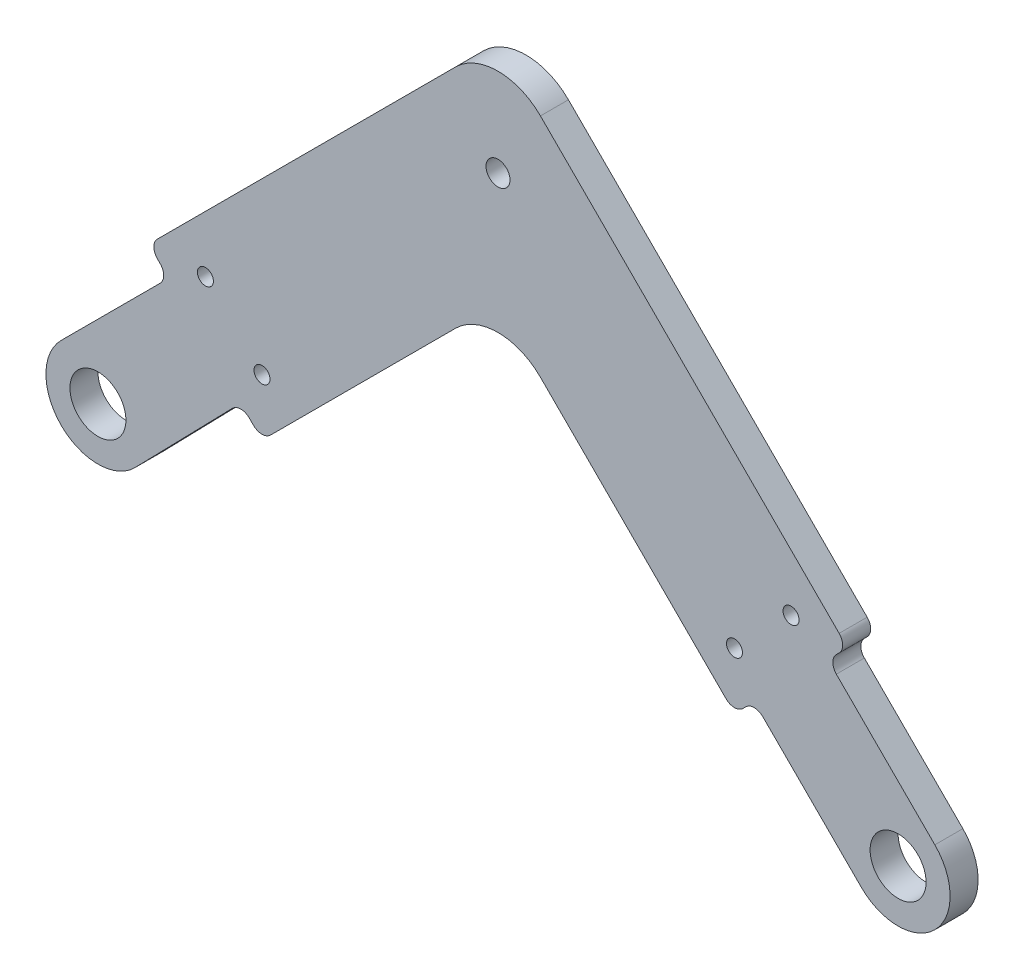
ISO-10303-21;
HEADER;
FILE_DESCRIPTION(('STEP AP214'),'2;1');
FILE_NAME('part.step','',(''),(''),'','','');
FILE_SCHEMA(('AUTOMOTIVE_DESIGN { 1 0 10303 214 1 1 1 1 }'));
ENDSEC;
DATA;
#1=APPLICATION_CONTEXT('core data for automotive mechanical design processes');
#2=APPLICATION_PROTOCOL_DEFINITION('international standard','automotive_design',2000,#1);
#3=PRODUCT_CONTEXT('',#1,'mechanical');
#4=PRODUCT('Part','Part','',(#3));
#5=PRODUCT_RELATED_PRODUCT_CATEGORY('part','',(#4));
#6=PRODUCT_DEFINITION_FORMATION('','',#4);
#7=PRODUCT_DEFINITION_CONTEXT('part definition',#1,'design');
#8=PRODUCT_DEFINITION('design','',#6,#7);
#9=PRODUCT_DEFINITION_SHAPE('','',#8);
#10=(LENGTH_UNIT() NAMED_UNIT(*) SI_UNIT(.MILLI.,.METRE.));
#11=(NAMED_UNIT(*) PLANE_ANGLE_UNIT() SI_UNIT($,.RADIAN.));
#12=(NAMED_UNIT(*) SI_UNIT($,.STERADIAN.) SOLID_ANGLE_UNIT());
#13=UNCERTAINTY_MEASURE_WITH_UNIT(LENGTH_MEASURE(1.E-05),#10,'distance_accuracy_value','');
#14=(GEOMETRIC_REPRESENTATION_CONTEXT(3) GLOBAL_UNCERTAINTY_ASSIGNED_CONTEXT((#13)) GLOBAL_UNIT_ASSIGNED_CONTEXT((#10,
#11,#12)) REPRESENTATION_CONTEXT('',''));
#15=CARTESIAN_POINT('',(0.,0.,0.));
#16=DIRECTION('',(0.,0.,1.));
#17=DIRECTION('',(1.,0.,0.));
#18=AXIS2_PLACEMENT_3D('',#15,#16,#17);
#19=CARTESIAN_POINT('',(0.,0.,3.5));
#20=DIRECTION('',(0.,0.,1.));
#21=DIRECTION('',(1.,0.,0.));
#22=AXIS2_PLACEMENT_3D('',#19,#20,#21);
#23=PLANE('',#22);
#24=CARTESIAN_POINT('',(-20.4454836869607,13.3744158750953,3.5));
#25=DIRECTION('',(0.,0.,1.));
#26=DIRECTION('',(1.,0.,0.));
#27=AXIS2_PLACEMENT_3D('',#24,#25,#26);
#28=CIRCLE('',#27,1.);
#29=CARTESIAN_POINT('',(-19.4454836869607,13.3744158750953,3.5));
#30=VERTEX_POINT('',#29);
#31=EDGE_CURVE('E839',#30,#30,#28,.T.);
#32=ORIENTED_EDGE('',*,*,#31,.F.);
#33=EDGE_LOOP('',(#32));
#34=FACE_BOUND('',#33,.T.);
#35=CARTESIAN_POINT('',(-50.,50.,3.5));
#36=DIRECTION('',(0.,0.,1.));
#37=DIRECTION('',(1.,0.,0.));
#38=AXIS2_PLACEMENT_3D('',#35,#36,#37);
#39=CIRCLE('',#38,1.5);
#40=CARTESIAN_POINT('',(-48.5,50.,3.5));
#41=VERTEX_POINT('',#40);
#42=EDGE_CURVE('E855',#41,#41,#39,.T.);
#43=ORIENTED_EDGE('',*,*,#42,.F.);
#44=EDGE_LOOP('',(#43));
#45=FACE_BOUND('',#44,.T.);
#46=CARTESIAN_POINT('',(-100.,0.,3.5));
#47=DIRECTION('',(0.,0.,1.));
#48=DIRECTION('',(1.,0.,0.));
#49=AXIS2_PLACEMENT_3D('',#46,#47,#48);
#50=CIRCLE('',#49,3.50000000000001);
#51=CARTESIAN_POINT('',(-96.5,0.,3.5));
#52=VERTEX_POINT('',#51);
#53=EDGE_CURVE('E871',#52,#52,#50,.T.);
#54=ORIENTED_EDGE('',*,*,#53,.F.);
#55=EDGE_LOOP('',(#54));
#56=FACE_BOUND('',#55,.T.);
#57=DIRECTION('',(0.707106781186553,0.707106781186542,0.));
#58=VECTOR('',#57,1.);
#59=CARTESIAN_POINT('',(-8.7782217973827,17.9706099528078,3.5));
#60=LINE('',#59,#58);
#61=CARTESIAN_POINT('',(-7.71756162560286,19.0312701245876,3.5));
#62=VERTEX_POINT('',#61);
#63=CARTESIAN_POINT('',(-7.36400823500959,19.3848235151809,3.5));
#64=VERTEX_POINT('',#63);
#65=EDGE_CURVE('E235',#62,#64,#60,.T.);
#66=ORIENTED_EDGE('',*,*,#65,.T.);
#67=CARTESIAN_POINT('',(-8.4246684067894,20.4454836869607,3.5));
#68=DIRECTION('',(0.,0.,1.));
#69=DIRECTION('',(1.,0.,0.));
#70=AXIS2_PLACEMENT_3D('',#67,#68,#69);
#71=CIRCLE('',#70,1.5);
#72=CARTESIAN_POINT('',(-7.36400823500958,21.5061438587406,3.5));
#73=VERTEX_POINT('',#72);
#74=EDGE_CURVE('E427',#64,#73,#71,.T.);
#75=ORIENTED_EDGE('',*,*,#74,.T.);
#76=DIRECTION('',(-0.707106781186548,0.707106781186547,0.));
#77=VECTOR('',#76,1.);
#78=CARTESIAN_POINT('',(-6.30334806322975,20.4454836869607,3.5));
#79=LINE('',#78,#77);
#80=CARTESIAN_POINT('',(-44.6966991411009,58.8388347648318,3.5));
#81=VERTEX_POINT('',#80);
#82=EDGE_CURVE('E241',#73,#81,#79,.T.);
#83=ORIENTED_EDGE('',*,*,#82,.T.);
#84=CARTESIAN_POINT('',(-50.,53.5355339059327,3.5));
#85=DIRECTION('',(0.,0.,1.));
#86=DIRECTION('',(1.,0.,0.));
#87=AXIS2_PLACEMENT_3D('',#84,#85,#86);
#88=CIRCLE('',#87,7.5);
#89=CARTESIAN_POINT('',(-55.3033008588991,58.8388347648318,3.5));
#90=VERTEX_POINT('',#89);
#91=EDGE_CURVE('E332',#81,#90,#88,.T.);
#92=ORIENTED_EDGE('',*,*,#91,.T.);
#93=DIRECTION('',(-0.707106781186548,-0.707106781186548,0.));
#94=VECTOR('',#93,1.);
#95=CARTESIAN_POINT('',(-50.,64.142135623731,3.5));
#96=LINE('',#95,#94);
#97=CARTESIAN_POINT('',(-92.5753787975413,21.5667568261897,3.5));
#98=VERTEX_POINT('',#97);
#99=EDGE_CURVE('E244',#90,#98,#96,.T.);
#100=ORIENTED_EDGE('',*,*,#99,.T.);
#101=CARTESIAN_POINT('',(-91.5147186257614,20.5060966544099,3.5));
#102=DIRECTION('',(0.,0.,1.));
#103=DIRECTION('',(1.,0.,0.));
#104=AXIS2_PLACEMENT_3D('',#101,#102,#103);
#105=CIRCLE('',#104,1.5);
#106=CARTESIAN_POINT('',(-92.5753787975413,19.4454364826301,3.5));
#107=VERTEX_POINT('',#106);
#108=EDGE_CURVE('E372',#98,#107,#105,.T.);
#109=ORIENTED_EDGE('',*,*,#108,.T.);
#110=DIRECTION('',(0.707106781186546,-0.707106781186548,0.));
#111=VECTOR('',#110,1.);
#112=CARTESIAN_POINT('',(-93.6360389693211,20.5060966544099,3.5));
#113=LINE('',#112,#111);
#114=CARTESIAN_POINT('',(-92.221825406948,19.0918830920368,3.5));
#115=VERTEX_POINT('',#114);
#116=EDGE_CURVE('E248',#107,#115,#113,.T.);
#117=ORIENTED_EDGE('',*,*,#116,.T.);
#118=CARTESIAN_POINT('',(-93.2824855787278,18.031222920257,3.5));
#119=DIRECTION('',(0.,0.,1.));
#120=DIRECTION('',(1.,0.,0.));
#121=AXIS2_PLACEMENT_3D('',#118,#119,#120);
#122=CIRCLE('',#121,1.5);
#123=CARTESIAN_POINT('',(-92.221825406948,16.9705627484771,3.5));
#124=VERTEX_POINT('',#123);
#125=EDGE_CURVE('E11',#115,#124,#122,.F.);
#126=ORIENTED_EDGE('',*,*,#125,.T.);
#127=DIRECTION('',(-0.707106781186548,-0.707106781186547,0.));
#128=VECTOR('',#127,1.);
#129=CARTESIAN_POINT('',(-91.1611652351682,18.031222920257,3.5));
#130=LINE('',#129,#128);
#131=CARTESIAN_POINT('',(-104.596194077713,4.59619407771256,3.5));
#132=VERTEX_POINT('',#131);
#133=EDGE_CURVE('E251',#124,#132,#130,.T.);
#134=ORIENTED_EDGE('',*,*,#133,.T.);
#135=CARTESIAN_POINT('',(-100.,0.,3.5));
#136=DIRECTION('',(0.,0.,1.));
#137=DIRECTION('',(1.,0.,0.));
#138=AXIS2_PLACEMENT_3D('',#135,#136,#137);
#139=CIRCLE('',#138,6.50000000000001);
#140=CARTESIAN_POINT('',(-95.3423988123256,-4.53395535670277,3.5));
#141=VERTEX_POINT('',#140);
#142=EDGE_CURVE('E254',#132,#141,#139,.T.);
#143=ORIENTED_EDGE('',*,*,#142,.T.);
#144=DIRECTION('',(0.697531593338886,0.71655402887299,0.));
#145=VECTOR('',#144,1.);
#146=CARTESIAN_POINT('',(-82.1490907242917,9.01914840938048,3.5));
#147=LINE('',#146,#145);
#148=CARTESIAN_POINT('',(-83.2095576863492,7.92976137457723,3.5));
#149=VERTEX_POINT('',#148);
#150=EDGE_CURVE('E257',#141,#149,#147,.T.);
#151=ORIENTED_EDGE('',*,*,#150,.T.);
#152=CARTESIAN_POINT('',(-82.1347266430397,6.8834639845689,3.5));
#153=DIRECTION('',(0.,0.,1.));
#154=DIRECTION('',(1.,0.,0.));
#155=AXIS2_PLACEMENT_3D('',#152,#153,#154);
#156=CIRCLE('',#155,1.5);
#157=CARTESIAN_POINT('',(-81.0740664712599,7.94412415634872,3.5));
#158=VERTEX_POINT('',#157);
#159=EDGE_CURVE('E405',#149,#158,#156,.F.);
#160=ORIENTED_EDGE('',*,*,#159,.T.);
#161=DIRECTION('',(0.707106781186547,-0.707106781186548,0.));
#162=VECTOR('',#161,1.);
#163=CARTESIAN_POINT('',(-82.1490907242917,9.01914840938048,3.5));
#164=LINE('',#163,#162);
#165=CARTESIAN_POINT('',(-80.5545635173699,7.42462120245875,3.5));
#166=VERTEX_POINT('',#165);
#167=EDGE_CURVE('E311',#158,#166,#164,.T.);
#168=ORIENTED_EDGE('',*,*,#167,.T.);
#169=CARTESIAN_POINT('',(-79.4939033455901,8.48528137423857,3.5));
#170=DIRECTION('',(0.,0.,1.));
#171=DIRECTION('',(1.,0.,0.));
#172=AXIS2_PLACEMENT_3D('',#169,#170,#171);
#173=CIRCLE('',#172,1.5);
#174=CARTESIAN_POINT('',(-78.4332431738103,7.42462120245875,3.5));
#175=VERTEX_POINT('',#174);
#176=EDGE_CURVE('E369',#166,#175,#173,.T.);
#177=ORIENTED_EDGE('',*,*,#176,.T.);
#178=DIRECTION('',(0.707106781186548,0.707106781186548,0.));
#179=VECTOR('',#178,1.);
#180=CARTESIAN_POINT('',(-79.4939033455901,6.36396103067893,3.5));
#181=LINE('',#180,#179);
#182=CARTESIAN_POINT('',(-55.3033008588991,30.5545635173699,3.5));
#183=VERTEX_POINT('',#182);
#184=EDGE_CURVE('E483',#175,#183,#181,.T.);
#185=ORIENTED_EDGE('',*,*,#184,.T.);
#186=CARTESIAN_POINT('',(-50.,25.2512626584708,3.5));
#187=DIRECTION('',(0.,0.,1.));
#188=DIRECTION('',(1.,0.,0.));
#189=AXIS2_PLACEMENT_3D('',#186,#187,#188);
#190=CIRCLE('',#189,7.5);
#191=CARTESIAN_POINT('',(-44.6966991411009,30.5545635173699,3.5));
#192=VERTEX_POINT('',#191);
#193=EDGE_CURVE('E347',#183,#192,#190,.F.);
#194=ORIENTED_EDGE('',*,*,#193,.T.);
#195=DIRECTION('',(0.707106781186548,-0.707106781186547,0.));
#196=VECTOR('',#195,1.);
#197=CARTESIAN_POINT('',(-50.,35.857864376269,3.5));
#198=LINE('',#197,#196);
#199=CARTESIAN_POINT('',(-21.5061438587405,7.3640082350096,3.5));
#200=VERTEX_POINT('',#199);
#201=EDGE_CURVE('E487',#192,#200,#198,.T.);
#202=ORIENTED_EDGE('',*,*,#201,.T.);
#203=CARTESIAN_POINT('',(-20.4454836869607,8.42466840678942,3.5));
#204=DIRECTION('',(0.,0.,1.));
#205=DIRECTION('',(1.,0.,0.));
#206=AXIS2_PLACEMENT_3D('',#203,#204,#205);
#207=CIRCLE('',#206,1.5);
#208=CARTESIAN_POINT('',(-19.3848235151809,7.3640082350096,3.5));
#209=VERTEX_POINT('',#208);
#210=EDGE_CURVE('E366',#200,#209,#207,.T.);
#211=ORIENTED_EDGE('',*,*,#210,.T.);
#212=DIRECTION('',(0.707106781186542,0.707106781186553,0.));
#213=VECTOR('',#212,1.);
#214=CARTESIAN_POINT('',(-20.4454836869607,6.30334806322977,3.5));
#215=LINE('',#214,#213);
#216=CARTESIAN_POINT('',(-19.0312701245876,7.71756162560284,3.5));
#217=VERTEX_POINT('',#216);
#218=EDGE_CURVE('E215',#209,#217,#215,.T.);
#219=ORIENTED_EDGE('',*,*,#218,.T.);
#220=CARTESIAN_POINT('',(-17.9706099528078,6.65690145382303,3.5));
#221=DIRECTION('',(0.,0.,1.));
#222=DIRECTION('',(1.,0.,0.));
#223=AXIS2_PLACEMENT_3D('',#220,#221,#222);
#224=CIRCLE('',#223,1.5);
#225=CARTESIAN_POINT('',(-16.909949781028,7.71756162560285,3.5));
#226=VERTEX_POINT('',#225);
#227=EDGE_CURVE('E210',#217,#226,#224,.F.);
#228=ORIENTED_EDGE('',*,*,#227,.T.);
#229=DIRECTION('',(0.707106781186548,-0.707106781186547,0.));
#230=VECTOR('',#229,1.);
#231=CARTESIAN_POINT('',(-17.9706099528078,8.77822179738268,3.5));
#232=LINE('',#231,#230);
#233=CARTESIAN_POINT('',(-4.59619407771257,-4.59619407771256,3.5));
#234=VERTEX_POINT('',#233);
#235=EDGE_CURVE('E200',#226,#234,#232,.T.);
#236=ORIENTED_EDGE('',*,*,#235,.T.);
#237=CARTESIAN_POINT('',(0.,0.,3.5));
#238=DIRECTION('',(0.,0.,1.));
#239=DIRECTION('',(1.,0.,0.));
#240=AXIS2_PLACEMENT_3D('',#237,#238,#239);
#241=CIRCLE('',#240,6.50000000000001);
#242=CARTESIAN_POINT('',(4.59619407771257,4.59619407771257,3.5));
#243=VERTEX_POINT('',#242);
#244=EDGE_CURVE('E206',#234,#243,#241,.T.);
#245=ORIENTED_EDGE('',*,*,#244,.T.);
#246=DIRECTION('',(-0.707106781186548,0.707106781186547,0.));
#247=VECTOR('',#246,1.);
#248=CARTESIAN_POINT('',(-8.7782217973827,17.9706099528078,3.5));
#249=LINE('',#248,#247);
#250=CARTESIAN_POINT('',(-7.71756162560287,16.909949781028,3.5));
#251=VERTEX_POINT('',#250);
#252=EDGE_CURVE('E232',#243,#251,#249,.T.);
#253=ORIENTED_EDGE('',*,*,#252,.T.);
#254=CARTESIAN_POINT('',(-6.65690145382305,17.9706099528078,3.5));
#255=DIRECTION('',(0.,0.,1.));
#256=DIRECTION('',(1.,0.,0.));
#257=AXIS2_PLACEMENT_3D('',#254,#255,#256);
#258=CIRCLE('',#257,1.5);
#259=EDGE_CURVE('E436',#251,#62,#258,.F.);
#260=ORIENTED_EDGE('',*,*,#259,.T.);
#261=EDGE_LOOP('',(#66,#75,#83,#92,#100,#109,#117,#126,#134,#143,#151,#160,#168,#177,#185,#194,
#202,#211,#219,#228,#236,#245,#253,#260));
#262=FACE_BOUND('',#261,.T.);
#263=CARTESIAN_POINT('',(0.,0.,3.5));
#264=DIRECTION('',(0.,0.,1.));
#265=DIRECTION('',(1.,0.,0.));
#266=AXIS2_PLACEMENT_3D('',#263,#264,#265);
#267=CIRCLE('',#266,3.50000000000001);
#268=CARTESIAN_POINT('',(3.50000000000001,0.,3.5));
#269=VERTEX_POINT('',#268);
#270=EDGE_CURVE('E267',#269,#269,#267,.T.);
#271=ORIENTED_EDGE('',*,*,#270,.F.);
#272=EDGE_LOOP('',(#271));
#273=FACE_BOUND('',#272,.T.);
#274=CARTESIAN_POINT('',(-86.5649711574556,20.5060966544099,3.5));
#275=DIRECTION('',(0.,0.,1.));
#276=DIRECTION('',(1.,0.,0.));
#277=AXIS2_PLACEMENT_3D('',#274,#275,#276);
#278=CIRCLE('',#277,0.999999999999998);
#279=CARTESIAN_POINT('',(-85.5649711574556,20.5060966544099,3.5));
#280=VERTEX_POINT('',#279);
#281=EDGE_CURVE('E863',#280,#280,#278,.T.);
#282=ORIENTED_EDGE('',*,*,#281,.F.);
#283=EDGE_LOOP('',(#282));
#284=FACE_BOUND('',#283,.T.);
#285=CARTESIAN_POINT('',(-13.3744158750952,20.4454836869608,3.5));
#286=DIRECTION('',(0.,0.,1.));
#287=DIRECTION('',(1.,0.,0.));
#288=AXIS2_PLACEMENT_3D('',#285,#286,#287);
#289=CIRCLE('',#288,1.);
#290=CARTESIAN_POINT('',(-12.3744158750952,20.4454836869608,3.5));
#291=VERTEX_POINT('',#290);
#292=EDGE_CURVE('E847',#291,#291,#289,.T.);
#293=ORIENTED_EDGE('',*,*,#292,.F.);
#294=EDGE_LOOP('',(#293));
#295=FACE_BOUND('',#294,.T.);
#296=CARTESIAN_POINT('',(-79.4939033455901,13.4350288425444,3.5));
#297=DIRECTION('',(0.,0.,1.));
#298=DIRECTION('',(1.,0.,0.));
#299=AXIS2_PLACEMENT_3D('',#296,#297,#298);
#300=CIRCLE('',#299,0.999999999999998);
#301=CARTESIAN_POINT('',(-78.4939033455901,13.4350288425444,3.5));
#302=VERTEX_POINT('',#301);
#303=EDGE_CURVE('E828',#302,#302,#300,.T.);
#304=ORIENTED_EDGE('',*,*,#303,.F.);
#305=EDGE_LOOP('',(#304));
#306=FACE_BOUND('',#305,.T.);
#307=ADVANCED_FACE('F39',(#34,#45,#56,#262,#273,#284,#295,#306),#23,.T.);
#308=CARTESIAN_POINT('',(0.,0.,0.));
#309=DIRECTION('',(0.,0.,1.));
#310=DIRECTION('',(1.,0.,0.));
#311=AXIS2_PLACEMENT_3D('',#308,#309,#310);
#312=PLANE('',#311);
#313=DIRECTION('',(-0.707106781186548,0.707106781186547,0.));
#314=VECTOR('',#313,1.);
#315=CARTESIAN_POINT('',(-6.30334806322975,20.4454836869607,0.));
#316=LINE('',#315,#314);
#317=CARTESIAN_POINT('',(-7.36400823500958,21.5061438587406,0.));
#318=VERTEX_POINT('',#317);
#319=CARTESIAN_POINT('',(-44.6966991411009,58.8388347648318,0.));
#320=VERTEX_POINT('',#319);
#321=EDGE_CURVE('E291',#318,#320,#316,.T.);
#322=ORIENTED_EDGE('',*,*,#321,.F.);
#323=CARTESIAN_POINT('',(-8.4246684067894,20.4454836869607,0.));
#324=DIRECTION('',(0.,0.,1.));
#325=DIRECTION('',(1.,0.,0.));
#326=AXIS2_PLACEMENT_3D('',#323,#324,#325);
#327=CIRCLE('',#326,1.5);
#328=CARTESIAN_POINT('',(-7.36400823500959,19.3848235151809,0.));
#329=VERTEX_POINT('',#328);
#330=EDGE_CURVE('E417',#318,#329,#327,.F.);
#331=ORIENTED_EDGE('',*,*,#330,.T.);
#332=DIRECTION('',(0.707106781186553,0.707106781186542,0.));
#333=VECTOR('',#332,1.);
#334=CARTESIAN_POINT('',(-8.7782217973827,17.9706099528078,0.));
#335=LINE('',#334,#333);
#336=CARTESIAN_POINT('',(-7.71756162560286,19.0312701245876,0.));
#337=VERTEX_POINT('',#336);
#338=EDGE_CURVE('E287',#337,#329,#335,.T.);
#339=ORIENTED_EDGE('',*,*,#338,.F.);
#340=CARTESIAN_POINT('',(-6.65690145382305,17.9706099528078,0.));
#341=DIRECTION('',(0.,0.,1.));
#342=DIRECTION('',(1.,0.,0.));
#343=AXIS2_PLACEMENT_3D('',#340,#341,#342);
#344=CIRCLE('',#343,1.5);
#345=CARTESIAN_POINT('',(-7.71756162560287,16.909949781028,0.));
#346=VERTEX_POINT('',#345);
#347=EDGE_CURVE('E433',#337,#346,#344,.T.);
#348=ORIENTED_EDGE('',*,*,#347,.T.);
#349=DIRECTION('',(-0.707106781186548,0.707106781186547,0.));
#350=VECTOR('',#349,1.);
#351=CARTESIAN_POINT('',(-8.7782217973827,17.9706099528078,0.));
#352=LINE('',#351,#350);
#353=CARTESIAN_POINT('',(4.59619407771257,4.59619407771257,0.));
#354=VERTEX_POINT('',#353);
#355=EDGE_CURVE('E283',#354,#346,#352,.T.);
#356=ORIENTED_EDGE('',*,*,#355,.F.);
#357=CARTESIAN_POINT('',(0.,0.,0.));
#358=DIRECTION('',(0.,0.,1.));
#359=DIRECTION('',(1.,0.,0.));
#360=AXIS2_PLACEMENT_3D('',#357,#358,#359);
#361=CIRCLE('',#360,6.50000000000001);
#362=CARTESIAN_POINT('',(-4.59619407771257,-4.59619407771256,0.));
#363=VERTEX_POINT('',#362);
#364=EDGE_CURVE('E280',#363,#354,#361,.T.);
#365=ORIENTED_EDGE('',*,*,#364,.F.);
#366=DIRECTION('',(0.707106781186548,-0.707106781186547,0.));
#367=VECTOR('',#366,1.);
#368=CARTESIAN_POINT('',(-17.9706099528078,8.77822179738268,0.));
#369=LINE('',#368,#367);
#370=CARTESIAN_POINT('',(-16.909949781028,7.71756162560285,0.));
#371=VERTEX_POINT('',#370);
#372=EDGE_CURVE('E221',#371,#363,#369,.T.);
#373=ORIENTED_EDGE('',*,*,#372,.F.);
#374=CARTESIAN_POINT('',(-17.9706099528078,6.65690145382303,0.));
#375=DIRECTION('',(0.,0.,1.));
#376=DIRECTION('',(1.,0.,0.));
#377=AXIS2_PLACEMENT_3D('',#374,#375,#376);
#378=CIRCLE('',#377,1.5);
#379=CARTESIAN_POINT('',(-19.0312701245876,7.71756162560284,0.));
#380=VERTEX_POINT('',#379);
#381=EDGE_CURVE('E408',#371,#380,#378,.T.);
#382=ORIENTED_EDGE('',*,*,#381,.T.);
#383=DIRECTION('',(0.707106781186542,0.707106781186553,0.));
#384=VECTOR('',#383,1.);
#385=CARTESIAN_POINT('',(-20.4454836869607,6.30334806322977,0.));
#386=LINE('',#385,#384);
#387=CARTESIAN_POINT('',(-19.3848235151809,7.3640082350096,0.));
#388=VERTEX_POINT('',#387);
#389=EDGE_CURVE('E274',#388,#380,#386,.T.);
#390=ORIENTED_EDGE('',*,*,#389,.F.);
#391=CARTESIAN_POINT('',(-20.4454836869607,8.42466840678942,0.));
#392=DIRECTION('',(0.,0.,1.));
#393=DIRECTION('',(1.,0.,0.));
#394=AXIS2_PLACEMENT_3D('',#391,#392,#393);
#395=CIRCLE('',#394,1.5);
#396=CARTESIAN_POINT('',(-21.5061438587405,7.3640082350096,0.));
#397=VERTEX_POINT('',#396);
#398=EDGE_CURVE('E354',#388,#397,#395,.F.);
#399=ORIENTED_EDGE('',*,*,#398,.T.);
#400=DIRECTION('',(0.707106781186548,-0.707106781186547,0.));
#401=VECTOR('',#400,1.);
#402=CARTESIAN_POINT('',(-50.,35.857864376269,0.));
#403=LINE('',#402,#401);
#404=CARTESIAN_POINT('',(-44.6966991411009,30.5545635173699,0.));
#405=VERTEX_POINT('',#404);
#406=EDGE_CURVE('E270',#405,#397,#403,.T.);
#407=ORIENTED_EDGE('',*,*,#406,.F.);
#408=CARTESIAN_POINT('',(-50.,25.2512626584708,0.));
#409=DIRECTION('',(0.,0.,1.));
#410=DIRECTION('',(1.,0.,0.));
#411=AXIS2_PLACEMENT_3D('',#408,#409,#410);
#412=CIRCLE('',#411,7.5);
#413=CARTESIAN_POINT('',(-55.3033008588991,30.5545635173699,0.));
#414=VERTEX_POINT('',#413);
#415=EDGE_CURVE('E343',#405,#414,#412,.T.);
#416=ORIENTED_EDGE('',*,*,#415,.T.);
#417=DIRECTION('',(0.707106781186548,0.707106781186548,0.));
#418=VECTOR('',#417,1.);
#419=CARTESIAN_POINT('',(-79.4939033455901,6.36396103067893,0.));
#420=LINE('',#419,#418);
#421=CARTESIAN_POINT('',(-78.4332431738103,7.42462120245875,0.));
#422=VERTEX_POINT('',#421);
#423=EDGE_CURVE('E266',#422,#414,#420,.T.);
#424=ORIENTED_EDGE('',*,*,#423,.F.);
#425=CARTESIAN_POINT('',(-79.4939033455901,8.48528137423857,0.));
#426=DIRECTION('',(0.,0.,1.));
#427=DIRECTION('',(1.,0.,0.));
#428=AXIS2_PLACEMENT_3D('',#425,#426,#427);
#429=CIRCLE('',#428,1.5);
#430=CARTESIAN_POINT('',(-80.5545635173699,7.42462120245875,0.));
#431=VERTEX_POINT('',#430);
#432=EDGE_CURVE('E357',#422,#431,#429,.F.);
#433=ORIENTED_EDGE('',*,*,#432,.T.);
#434=DIRECTION('',(0.707106781186547,-0.707106781186548,0.));
#435=VECTOR('',#434,1.);
#436=CARTESIAN_POINT('',(-82.1490907242917,9.01914840938048,0.));
#437=LINE('',#436,#435);
#438=CARTESIAN_POINT('',(-81.0740664712599,7.94412415634872,0.));
#439=VERTEX_POINT('',#438);
#440=EDGE_CURVE('E262',#439,#431,#437,.T.);
#441=ORIENTED_EDGE('',*,*,#440,.F.);
#442=CARTESIAN_POINT('',(-82.1347266430397,6.8834639845689,0.));
#443=DIRECTION('',(0.,0.,1.));
#444=DIRECTION('',(1.,0.,0.));
#445=AXIS2_PLACEMENT_3D('',#442,#443,#444);
#446=CIRCLE('',#445,1.5);
#447=CARTESIAN_POINT('',(-83.2095576863492,7.92976137457723,0.));
#448=VERTEX_POINT('',#447);
#449=EDGE_CURVE('E402',#439,#448,#446,.T.);
#450=ORIENTED_EDGE('',*,*,#449,.T.);
#451=DIRECTION('',(0.697531593338886,0.71655402887299,0.));
#452=VECTOR('',#451,1.);
#453=CARTESIAN_POINT('',(-82.1490907242917,9.01914840938048,0.));
#454=LINE('',#453,#452);
#455=CARTESIAN_POINT('',(-95.3423988123256,-4.53395535670277,0.));
#456=VERTEX_POINT('',#455);
#457=EDGE_CURVE('E307',#456,#448,#454,.T.);
#458=ORIENTED_EDGE('',*,*,#457,.F.);
#459=CARTESIAN_POINT('',(-100.,0.,0.));
#460=DIRECTION('',(0.,0.,1.));
#461=DIRECTION('',(1.,0.,0.));
#462=AXIS2_PLACEMENT_3D('',#459,#460,#461);
#463=CIRCLE('',#462,6.50000000000001);
#464=CARTESIAN_POINT('',(-104.596194077713,4.59619407771256,0.));
#465=VERTEX_POINT('',#464);
#466=EDGE_CURVE('E304',#465,#456,#463,.T.);
#467=ORIENTED_EDGE('',*,*,#466,.F.);
#468=DIRECTION('',(-0.707106781186548,-0.707106781186547,0.));
#469=VECTOR('',#468,1.);
#470=CARTESIAN_POINT('',(-91.1611652351682,18.031222920257,0.));
#471=LINE('',#470,#469);
#472=CARTESIAN_POINT('',(-92.221825406948,16.9705627484771,0.));
#473=VERTEX_POINT('',#472);
#474=EDGE_CURVE('E301',#473,#465,#471,.T.);
#475=ORIENTED_EDGE('',*,*,#474,.F.);
#476=CARTESIAN_POINT('',(-93.2824855787278,18.031222920257,0.));
#477=DIRECTION('',(0.,0.,1.));
#478=DIRECTION('',(1.,0.,0.));
#479=AXIS2_PLACEMENT_3D('',#476,#477,#478);
#480=CIRCLE('',#479,1.5);
#481=CARTESIAN_POINT('',(-92.221825406948,19.0918830920368,0.));
#482=VERTEX_POINT('',#481);
#483=EDGE_CURVE('E48',#473,#482,#480,.T.);
#484=ORIENTED_EDGE('',*,*,#483,.T.);
#485=DIRECTION('',(0.707106781186546,-0.707106781186548,0.));
#486=VECTOR('',#485,1.);
#487=CARTESIAN_POINT('',(-93.6360389693211,20.5060966544099,0.));
#488=LINE('',#487,#486);
#489=CARTESIAN_POINT('',(-92.5753787975413,19.4454364826301,0.));
#490=VERTEX_POINT('',#489);
#491=EDGE_CURVE('E298',#490,#482,#488,.T.);
#492=ORIENTED_EDGE('',*,*,#491,.F.);
#493=CARTESIAN_POINT('',(-91.5147186257614,20.5060966544099,0.));
#494=DIRECTION('',(0.,0.,1.));
#495=DIRECTION('',(1.,0.,0.));
#496=AXIS2_PLACEMENT_3D('',#493,#494,#495);
#497=CIRCLE('',#496,1.5);
#498=CARTESIAN_POINT('',(-92.5753787975413,21.5667568261897,0.));
#499=VERTEX_POINT('',#498);
#500=EDGE_CURVE('E360',#490,#499,#497,.F.);
#501=ORIENTED_EDGE('',*,*,#500,.T.);
#502=DIRECTION('',(-0.707106781186548,-0.707106781186548,0.));
#503=VECTOR('',#502,1.);
#504=CARTESIAN_POINT('',(-50.,64.142135623731,0.));
#505=LINE('',#504,#503);
#506=CARTESIAN_POINT('',(-55.3033008588991,58.8388347648318,0.));
#507=VERTEX_POINT('',#506);
#508=EDGE_CURVE('E294',#507,#499,#505,.T.);
#509=ORIENTED_EDGE('',*,*,#508,.F.);
#510=CARTESIAN_POINT('',(-50.,53.5355339059327,0.));
#511=DIRECTION('',(0.,0.,1.));
#512=DIRECTION('',(1.,0.,0.));
#513=AXIS2_PLACEMENT_3D('',#510,#511,#512);
#514=CIRCLE('',#513,7.5);
#515=EDGE_CURVE('E324',#507,#320,#514,.F.);
#516=ORIENTED_EDGE('',*,*,#515,.T.);
#517=EDGE_LOOP('',(#322,#331,#339,#348,#356,#365,#373,#382,#390,#399,#407,#416,#424,#433,#441,
#450,#458,#467,#475,#484,#492,#501,#509,#516));
#518=FACE_BOUND('',#517,.T.);
#519=CARTESIAN_POINT('',(0.,0.,0.));
#520=DIRECTION('',(0.,0.,1.));
#521=DIRECTION('',(1.,0.,0.));
#522=AXIS2_PLACEMENT_3D('',#519,#520,#521);
#523=CIRCLE('',#522,3.50000000000001);
#524=CARTESIAN_POINT('',(3.50000000000001,0.,0.));
#525=VERTEX_POINT('',#524);
#526=EDGE_CURVE('E875',#525,#525,#523,.T.);
#527=ORIENTED_EDGE('',*,*,#526,.T.);
#528=EDGE_LOOP('',(#527));
#529=FACE_BOUND('',#528,.T.);
#530=CARTESIAN_POINT('',(-100.,0.,0.));
#531=DIRECTION('',(0.,0.,1.));
#532=DIRECTION('',(1.,0.,0.));
#533=AXIS2_PLACEMENT_3D('',#530,#531,#532);
#534=CIRCLE('',#533,3.50000000000001);
#535=CARTESIAN_POINT('',(-96.5,0.,0.));
#536=VERTEX_POINT('',#535);
#537=EDGE_CURVE('E867',#536,#536,#534,.T.);
#538=ORIENTED_EDGE('',*,*,#537,.T.);
#539=EDGE_LOOP('',(#538));
#540=FACE_BOUND('',#539,.T.);
#541=CARTESIAN_POINT('',(-86.5649711574556,20.5060966544099,0.));
#542=DIRECTION('',(0.,0.,1.));
#543=DIRECTION('',(1.,0.,0.));
#544=AXIS2_PLACEMENT_3D('',#541,#542,#543);
#545=CIRCLE('',#544,0.999999999999998);
#546=CARTESIAN_POINT('',(-85.5649711574556,20.5060966544099,0.));
#547=VERTEX_POINT('',#546);
#548=EDGE_CURVE('E859',#547,#547,#545,.T.);
#549=ORIENTED_EDGE('',*,*,#548,.T.);
#550=EDGE_LOOP('',(#549));
#551=FACE_BOUND('',#550,.T.);
#552=CARTESIAN_POINT('',(-50.,50.,0.));
#553=DIRECTION('',(0.,0.,1.));
#554=DIRECTION('',(1.,0.,0.));
#555=AXIS2_PLACEMENT_3D('',#552,#553,#554);
#556=CIRCLE('',#555,1.5);
#557=CARTESIAN_POINT('',(-48.5,50.,0.));
#558=VERTEX_POINT('',#557);
#559=EDGE_CURVE('E851',#558,#558,#556,.T.);
#560=ORIENTED_EDGE('',*,*,#559,.T.);
#561=EDGE_LOOP('',(#560));
#562=FACE_BOUND('',#561,.T.);
#563=CARTESIAN_POINT('',(-13.3744158750952,20.4454836869608,0.));
#564=DIRECTION('',(0.,0.,1.));
#565=DIRECTION('',(1.,0.,0.));
#566=AXIS2_PLACEMENT_3D('',#563,#564,#565);
#567=CIRCLE('',#566,1.);
#568=CARTESIAN_POINT('',(-12.3744158750952,20.4454836869608,0.));
#569=VERTEX_POINT('',#568);
#570=EDGE_CURVE('E843',#569,#569,#567,.T.);
#571=ORIENTED_EDGE('',*,*,#570,.T.);
#572=EDGE_LOOP('',(#571));
#573=FACE_BOUND('',#572,.T.);
#574=CARTESIAN_POINT('',(-20.4454836869607,13.3744158750953,0.));
#575=DIRECTION('',(0.,0.,1.));
#576=DIRECTION('',(1.,0.,0.));
#577=AXIS2_PLACEMENT_3D('',#574,#575,#576);
#578=CIRCLE('',#577,1.);
#579=CARTESIAN_POINT('',(-19.4454836869607,13.3744158750953,0.));
#580=VERTEX_POINT('',#579);
#581=EDGE_CURVE('E836',#580,#580,#578,.T.);
#582=ORIENTED_EDGE('',*,*,#581,.T.);
#583=EDGE_LOOP('',(#582));
#584=FACE_BOUND('',#583,.T.);
#585=CARTESIAN_POINT('',(-79.4939033455901,13.4350288425444,0.));
#586=DIRECTION('',(0.,0.,1.));
#587=DIRECTION('',(1.,0.,0.));
#588=AXIS2_PLACEMENT_3D('',#585,#586,#587);
#589=CIRCLE('',#588,0.999999999999998);
#590=CARTESIAN_POINT('',(-78.4939033455901,13.4350288425444,0.));
#591=VERTEX_POINT('',#590);
#592=EDGE_CURVE('E831',#591,#591,#589,.T.);
#593=ORIENTED_EDGE('',*,*,#592,.T.);
#594=EDGE_LOOP('',(#593));
#595=FACE_BOUND('',#594,.T.);
#596=ADVANCED_FACE('F454',(#518,#529,#540,#551,#562,#573,#584,#595),#312,.F.);
#597=CARTESIAN_POINT('',(-82.1490907242917,9.01914840938048,3.5));
#598=DIRECTION('',(0.707106781186548,0.707106781186547,0.));
#599=DIRECTION('',(-0.707106781186547,0.707106781186548,0.));
#600=AXIS2_PLACEMENT_3D('',#597,#598,#599);
#601=PLANE('',#600);
#602=ORIENTED_EDGE('',*,*,#167,.F.);
#603=DIRECTION('',(0.,0.,-1.));
#604=VECTOR('',#603,1.);
#605=CARTESIAN_POINT('',(-81.0740664712599,7.94412415634872,0.));
#606=LINE('',#605,#604);
#607=EDGE_CURVE('E378',#158,#439,#606,.T.);
#608=ORIENTED_EDGE('',*,*,#607,.T.);
#609=ORIENTED_EDGE('',*,*,#440,.T.);
#610=DIRECTION('',(0.,0.,-1.));
#611=VECTOR('',#610,1.);
#612=CARTESIAN_POINT('',(-80.5545635173699,7.42462120245875,3.5));
#613=LINE('',#612,#611);
#614=EDGE_CURVE('E375',#431,#166,#613,.F.);
#615=ORIENTED_EDGE('',*,*,#614,.T.);
#616=EDGE_LOOP('',(#602,#608,#609,#615));
#617=FACE_BOUND('',#616,.T.);
#618=ADVANCED_FACE('F473',(#617),#601,.F.);
#619=CARTESIAN_POINT('',(-79.4939033455901,6.36396103067893,3.5));
#620=DIRECTION('',(-0.707106781186548,0.707106781186547,0.));
#621=DIRECTION('',(-0.707106781186547,-0.707106781186548,0.));
#622=AXIS2_PLACEMENT_3D('',#619,#620,#621);
#623=PLANE('',#622);
#624=ORIENTED_EDGE('',*,*,#184,.F.);
#625=DIRECTION('',(0.,0.,-1.));
#626=VECTOR('',#625,1.);
#627=CARTESIAN_POINT('',(-78.4332431738103,7.42462120245875,3.5));
#628=LINE('',#627,#626);
#629=EDGE_CURVE('E385',#175,#422,#628,.T.);
#630=ORIENTED_EDGE('',*,*,#629,.T.);
#631=ORIENTED_EDGE('',*,*,#423,.T.);
#632=DIRECTION('',(0.,0.,-1.));
#633=VECTOR('',#632,1.);
#634=CARTESIAN_POINT('',(-55.3033008588991,30.5545635173699,3.5));
#635=LINE('',#634,#633);
#636=EDGE_CURVE('E339',#414,#183,#635,.F.);
#637=ORIENTED_EDGE('',*,*,#636,.T.);
#638=EDGE_LOOP('',(#624,#630,#631,#637));
#639=FACE_BOUND('',#638,.T.);
#640=ADVANCED_FACE('F482',(#639),#623,.F.);
#641=CARTESIAN_POINT('',(-50.,35.857864376269,3.5));
#642=DIRECTION('',(0.707106781186547,0.707106781186548,0.));
#643=DIRECTION('',(-0.707106781186548,0.707106781186547,0.));
#644=AXIS2_PLACEMENT_3D('',#641,#642,#643);
#645=PLANE('',#644);
#646=ORIENTED_EDGE('',*,*,#406,.T.);
#647=DIRECTION('',(0.,0.,-1.));
#648=VECTOR('',#647,1.);
#649=CARTESIAN_POINT('',(-21.5061438587405,7.36400823500959,3.5));
#650=LINE('',#649,#648);
#651=EDGE_CURVE('E399',#397,#200,#650,.F.);
#652=ORIENTED_EDGE('',*,*,#651,.T.);
#653=ORIENTED_EDGE('',*,*,#201,.F.);
#654=DIRECTION('',(0.,0.,-1.));
#655=VECTOR('',#654,1.);
#656=CARTESIAN_POINT('',(-44.6966991411009,30.5545635173699,0.));
#657=LINE('',#656,#655);
#658=EDGE_CURVE('E335',#192,#405,#657,.T.);
#659=ORIENTED_EDGE('',*,*,#658,.T.);
#660=EDGE_LOOP('',(#646,#652,#653,#659));
#661=FACE_BOUND('',#660,.T.);
#662=ADVANCED_FACE('F579',(#661),#645,.F.);
#663=CARTESIAN_POINT('',(-20.4454836869607,6.30334806322977,3.5));
#664=DIRECTION('',(-0.707106781186553,0.707106781186543,0.));
#665=DIRECTION('',(-0.707106781186543,-0.707106781186553,0.));
#666=AXIS2_PLACEMENT_3D('',#663,#664,#665);
#667=PLANE('',#666);
#668=ORIENTED_EDGE('',*,*,#389,.T.);
#669=DIRECTION('',(0.,0.,-1.));
#670=VECTOR('',#669,1.);
#671=CARTESIAN_POINT('',(-19.0312701245876,7.71756162560284,3.5));
#672=LINE('',#671,#670);
#673=EDGE_CURVE('E396',#380,#217,#672,.F.);
#674=ORIENTED_EDGE('',*,*,#673,.T.);
#675=ORIENTED_EDGE('',*,*,#218,.F.);
#676=DIRECTION('',(0.,0.,-1.));
#677=VECTOR('',#676,1.);
#678=CARTESIAN_POINT('',(-19.3848235151809,7.3640082350096,3.5));
#679=LINE('',#678,#677);
#680=EDGE_CURVE('E392',#209,#388,#679,.T.);
#681=ORIENTED_EDGE('',*,*,#680,.T.);
#682=EDGE_LOOP('',(#668,#674,#675,#681));
#683=FACE_BOUND('',#682,.T.);
#684=ADVANCED_FACE('F576',(#683),#667,.F.);
#685=CARTESIAN_POINT('',(-17.9706099528078,8.77822179738268,3.5));
#686=DIRECTION('',(0.707106781186547,0.707106781186548,0.));
#687=DIRECTION('',(-0.707106781186548,0.707106781186547,0.));
#688=AXIS2_PLACEMENT_3D('',#685,#686,#687);
#689=PLANE('',#688);
#690=ORIENTED_EDGE('',*,*,#235,.F.);
#691=DIRECTION('',(0.,0.,-1.));
#692=VECTOR('',#691,1.);
#693=CARTESIAN_POINT('',(-16.909949781028,7.71756162560285,0.));
#694=LINE('',#693,#692);
#695=EDGE_CURVE('E389',#226,#371,#694,.T.);
#696=ORIENTED_EDGE('',*,*,#695,.T.);
#697=ORIENTED_EDGE('',*,*,#372,.T.);
#698=DIRECTION('',(0.,0.,-1.));
#699=VECTOR('',#698,1.);
#700=CARTESIAN_POINT('',(-4.59619407771257,-4.59619407771256,3.5));
#701=LINE('',#700,#699);
#702=EDGE_CURVE('E218',#234,#363,#701,.T.);
#703=ORIENTED_EDGE('',*,*,#702,.F.);
#704=EDGE_LOOP('',(#690,#696,#697,#703));
#705=FACE_BOUND('',#704,.T.);
#706=ADVANCED_FACE('F219',(#705),#689,.F.);
#707=CARTESIAN_POINT('',(0.,0.,3.5));
#708=DIRECTION('',(0.,0.,-1.));
#709=DIRECTION('',(-1.,0.,0.));
#710=AXIS2_PLACEMENT_3D('',#707,#708,#709);
#711=CYLINDRICAL_SURFACE('',#710,6.50000000000001);
#712=ORIENTED_EDGE('',*,*,#364,.T.);
#713=DIRECTION('',(0.,0.,-1.));
#714=VECTOR('',#713,1.);
#715=CARTESIAN_POINT('',(4.59619407771257,4.59619407771257,3.5));
#716=LINE('',#715,#714);
#717=EDGE_CURVE('E226',#243,#354,#716,.T.);
#718=ORIENTED_EDGE('',*,*,#717,.F.);
#719=ORIENTED_EDGE('',*,*,#244,.F.);
#720=ORIENTED_EDGE('',*,*,#702,.T.);
#721=EDGE_LOOP('',(#712,#718,#719,#720));
#722=FACE_BOUND('',#721,.T.);
#723=ADVANCED_FACE('F228',(#722),#711,.T.);
#724=CARTESIAN_POINT('',(-8.7782217973827,17.9706099528078,3.5));
#725=DIRECTION('',(-0.707106781186547,-0.707106781186548,0.));
#726=DIRECTION('',(0.707106781186548,-0.707106781186547,0.));
#727=AXIS2_PLACEMENT_3D('',#724,#725,#726);
#728=PLANE('',#727);
#729=ORIENTED_EDGE('',*,*,#355,.T.);
#730=DIRECTION('',(0.,0.,-1.));
#731=VECTOR('',#730,1.);
#732=CARTESIAN_POINT('',(-7.71756162560287,16.909949781028,3.5));
#733=LINE('',#732,#731);
#734=EDGE_CURVE('E430',#346,#251,#733,.F.);
#735=ORIENTED_EDGE('',*,*,#734,.T.);
#736=ORIENTED_EDGE('',*,*,#252,.F.);
#737=ORIENTED_EDGE('',*,*,#717,.T.);
#738=EDGE_LOOP('',(#729,#735,#736,#737));
#739=FACE_BOUND('',#738,.T.);
#740=ADVANCED_FACE('F506',(#739),#728,.F.);
#741=CARTESIAN_POINT('',(-8.7782217973827,17.9706099528078,3.5));
#742=DIRECTION('',(-0.707106781186542,0.707106781186553,0.));
#743=DIRECTION('',(-0.707106781186553,-0.707106781186542,0.));
#744=AXIS2_PLACEMENT_3D('',#741,#742,#743);
#745=PLANE('',#744);
#746=ORIENTED_EDGE('',*,*,#338,.T.);
#747=DIRECTION('',(0.,0.,-1.));
#748=VECTOR('',#747,1.);
#749=CARTESIAN_POINT('',(-7.36400823500959,19.3848235151809,3.5));
#750=LINE('',#749,#748);
#751=EDGE_CURVE('E424',#329,#64,#750,.F.);
#752=ORIENTED_EDGE('',*,*,#751,.T.);
#753=ORIENTED_EDGE('',*,*,#65,.F.);
#754=DIRECTION('',(0.,0.,-1.));
#755=VECTOR('',#754,1.);
#756=CARTESIAN_POINT('',(-7.71756162560286,19.0312701245876,0.));
#757=LINE('',#756,#755);
#758=EDGE_CURVE('E420',#62,#337,#757,.T.);
#759=ORIENTED_EDGE('',*,*,#758,.T.);
#760=EDGE_LOOP('',(#746,#752,#753,#759));
#761=FACE_BOUND('',#760,.T.);
#762=ADVANCED_FACE('F515',(#761),#745,.F.);
#763=CARTESIAN_POINT('',(-6.30334806322975,20.4454836869607,3.5));
#764=DIRECTION('',(-0.707106781186547,-0.707106781186548,0.));
#765=DIRECTION('',(0.707106781186548,-0.707106781186547,0.));
#766=AXIS2_PLACEMENT_3D('',#763,#764,#765);
#767=PLANE('',#766);
#768=ORIENTED_EDGE('',*,*,#82,.F.);
#769=DIRECTION('',(0.,0.,-1.));
#770=VECTOR('',#769,1.);
#771=CARTESIAN_POINT('',(-7.36400823500958,21.5061438587406,3.5));
#772=LINE('',#771,#770);
#773=EDGE_CURVE('E413',#73,#318,#772,.T.);
#774=ORIENTED_EDGE('',*,*,#773,.T.);
#775=ORIENTED_EDGE('',*,*,#321,.T.);
#776=DIRECTION('',(0.,0.,-1.));
#777=VECTOR('',#776,1.);
#778=CARTESIAN_POINT('',(-44.6966991411009,58.8388347648318,3.5));
#779=LINE('',#778,#777);
#780=EDGE_CURVE('E328',#320,#81,#779,.F.);
#781=ORIENTED_EDGE('',*,*,#780,.T.);
#782=EDGE_LOOP('',(#768,#774,#775,#781));
#783=FACE_BOUND('',#782,.T.);
#784=ADVANCED_FACE('F523',(#783),#767,.F.);
#785=CARTESIAN_POINT('',(-50.,64.142135623731,3.5));
#786=DIRECTION('',(0.707106781186547,-0.707106781186547,0.));
#787=DIRECTION('',(0.707106781186548,0.707106781186548,0.));
#788=AXIS2_PLACEMENT_3D('',#785,#786,#787);
#789=PLANE('',#788);
#790=ORIENTED_EDGE('',*,*,#508,.T.);
#791=DIRECTION('',(0.,0.,-1.));
#792=VECTOR('',#791,1.);
#793=CARTESIAN_POINT('',(-92.5753787975413,21.5667568261897,3.5));
#794=LINE('',#793,#792);
#795=EDGE_CURVE('E363',#499,#98,#794,.F.);
#796=ORIENTED_EDGE('',*,*,#795,.T.);
#797=ORIENTED_EDGE('',*,*,#99,.F.);
#798=DIRECTION('',(0.,0.,-1.));
#799=VECTOR('',#798,1.);
#800=CARTESIAN_POINT('',(-55.3033008588991,58.8388347648318,3.5));
#801=LINE('',#800,#799);
#802=EDGE_CURVE('E225',#90,#507,#801,.T.);
#803=ORIENTED_EDGE('',*,*,#802,.T.);
#804=EDGE_LOOP('',(#790,#796,#797,#803));
#805=FACE_BOUND('',#804,.T.);
#806=ADVANCED_FACE('F531',(#805),#789,.F.);
#807=CARTESIAN_POINT('',(-93.6360389693211,20.5060966544099,3.5));
#808=DIRECTION('',(0.707106781186548,0.707106781186547,0.));
#809=DIRECTION('',(-0.707106781186547,0.707106781186548,0.));
#810=AXIS2_PLACEMENT_3D('',#807,#808,#809);
#811=PLANE('',#810);
#812=ORIENTED_EDGE('',*,*,#491,.T.);
#813=DIRECTION('',(0.,0.,-1.));
#814=VECTOR('',#813,1.);
#815=CARTESIAN_POINT('',(-92.221825406948,19.0918830920368,3.5));
#816=LINE('',#815,#814);
#817=EDGE_CURVE('E61',#482,#115,#816,.F.);
#818=ORIENTED_EDGE('',*,*,#817,.T.);
#819=ORIENTED_EDGE('',*,*,#116,.F.);
#820=DIRECTION('',(0.,0.,-1.));
#821=VECTOR('',#820,1.);
#822=CARTESIAN_POINT('',(-92.5753787975413,19.4454364826301,3.5));
#823=LINE('',#822,#821);
#824=EDGE_CURVE('E350',#107,#490,#823,.T.);
#825=ORIENTED_EDGE('',*,*,#824,.T.);
#826=EDGE_LOOP('',(#812,#818,#819,#825));
#827=FACE_BOUND('',#826,.T.);
#828=ADVANCED_FACE('F538',(#827),#811,.F.);
#829=CARTESIAN_POINT('',(-91.1611652351682,18.031222920257,3.5));
#830=DIRECTION('',(0.707106781186548,-0.707106781186548,0.));
#831=DIRECTION('',(0.707106781186548,0.707106781186547,0.));
#832=AXIS2_PLACEMENT_3D('',#829,#830,#831);
#833=PLANE('',#832);
#834=ORIENTED_EDGE('',*,*,#133,.F.);
#835=DIRECTION('',(0.,0.,-1.));
#836=VECTOR('',#835,1.);
#837=CARTESIAN_POINT('',(-92.221825406948,16.9705627484771,0.));
#838=LINE('',#837,#836);
#839=EDGE_CURVE('E439',#124,#473,#838,.T.);
#840=ORIENTED_EDGE('',*,*,#839,.T.);
#841=ORIENTED_EDGE('',*,*,#474,.T.);
#842=DIRECTION('',(0.,0.,-1.));
#843=VECTOR('',#842,1.);
#844=CARTESIAN_POINT('',(-104.596194077713,4.59619407771256,3.5));
#845=LINE('',#844,#843);
#846=EDGE_CURVE('E315',#132,#465,#845,.T.);
#847=ORIENTED_EDGE('',*,*,#846,.F.);
#848=EDGE_LOOP('',(#834,#840,#841,#847));
#849=FACE_BOUND('',#848,.T.);
#850=ADVANCED_FACE('F448',(#849),#833,.F.);
#851=CARTESIAN_POINT('',(-100.,0.,3.5));
#852=DIRECTION('',(0.,0.,-1.));
#853=DIRECTION('',(-1.,0.,0.));
#854=AXIS2_PLACEMENT_3D('',#851,#852,#853);
#855=CYLINDRICAL_SURFACE('',#854,6.50000000000001);
#856=ORIENTED_EDGE('',*,*,#466,.T.);
#857=DIRECTION('',(0.,0.,-1.));
#858=VECTOR('',#857,1.);
#859=CARTESIAN_POINT('',(-95.3423988123256,-4.53395535670277,3.5));
#860=LINE('',#859,#858);
#861=EDGE_CURVE('E261',#141,#456,#860,.T.);
#862=ORIENTED_EDGE('',*,*,#861,.F.);
#863=ORIENTED_EDGE('',*,*,#142,.F.);
#864=ORIENTED_EDGE('',*,*,#846,.T.);
#865=EDGE_LOOP('',(#856,#862,#863,#864));
#866=FACE_BOUND('',#865,.T.);
#867=ADVANCED_FACE('F459',(#866),#855,.T.);
#868=CARTESIAN_POINT('',(-82.1490907242917,9.01914840938048,3.5));
#869=DIRECTION('',(-0.716554028872991,0.697531593338886,0.));
#870=DIRECTION('',(-0.697531593338886,-0.716554028872991,0.));
#871=AXIS2_PLACEMENT_3D('',#868,#869,#870);
#872=PLANE('',#871);
#873=ORIENTED_EDGE('',*,*,#457,.T.);
#874=DIRECTION('',(0.,0.,-1.));
#875=VECTOR('',#874,1.);
#876=CARTESIAN_POINT('',(-83.2095576863492,7.92976137457723,3.5));
#877=LINE('',#876,#875);
#878=EDGE_CURVE('E382',#448,#149,#877,.F.);
#879=ORIENTED_EDGE('',*,*,#878,.T.);
#880=ORIENTED_EDGE('',*,*,#150,.F.);
#881=ORIENTED_EDGE('',*,*,#861,.T.);
#882=EDGE_LOOP('',(#873,#879,#880,#881));
#883=FACE_BOUND('',#882,.T.);
#884=ADVANCED_FACE('F463',(#883),#872,.F.);
#885=CARTESIAN_POINT('',(0.,0.,3.5));
#886=DIRECTION('',(0.,0.,-1.));
#887=DIRECTION('',(-1.,0.,0.));
#888=AXIS2_PLACEMENT_3D('',#885,#886,#887);
#889=CYLINDRICAL_SURFACE('',#888,3.50000000000001);
#890=ORIENTED_EDGE('',*,*,#270,.T.);
#891=EDGE_LOOP('',(#890));
#892=FACE_BOUND('',#891,.T.);
#893=ORIENTED_EDGE('',*,*,#526,.F.);
#894=EDGE_LOOP('',(#893));
#895=FACE_BOUND('',#894,.T.);
#896=ADVANCED_FACE('F553',(#892,#895),#889,.F.);
#897=CARTESIAN_POINT('',(-100.,0.,3.5));
#898=DIRECTION('',(0.,0.,-1.));
#899=DIRECTION('',(-1.,0.,0.));
#900=AXIS2_PLACEMENT_3D('',#897,#898,#899);
#901=CYLINDRICAL_SURFACE('',#900,3.50000000000001);
#902=ORIENTED_EDGE('',*,*,#53,.T.);
#903=EDGE_LOOP('',(#902));
#904=FACE_BOUND('',#903,.T.);
#905=ORIENTED_EDGE('',*,*,#537,.F.);
#906=EDGE_LOOP('',(#905));
#907=FACE_BOUND('',#906,.T.);
#908=ADVANCED_FACE('F663',(#904,#907),#901,.F.);
#909=CARTESIAN_POINT('',(-86.5649711574556,20.5060966544099,3.5));
#910=DIRECTION('',(0.,0.,-1.));
#911=DIRECTION('',(-1.,0.,0.));
#912=AXIS2_PLACEMENT_3D('',#909,#910,#911);
#913=CYLINDRICAL_SURFACE('',#912,0.999999999999998);
#914=ORIENTED_EDGE('',*,*,#281,.T.);
#915=EDGE_LOOP('',(#914));
#916=FACE_BOUND('',#915,.T.);
#917=ORIENTED_EDGE('',*,*,#548,.F.);
#918=EDGE_LOOP('',(#917));
#919=FACE_BOUND('',#918,.T.);
#920=ADVANCED_FACE('F670',(#916,#919),#913,.F.);
#921=CARTESIAN_POINT('',(-50.,50.,3.5));
#922=DIRECTION('',(0.,0.,-1.));
#923=DIRECTION('',(-1.,0.,0.));
#924=AXIS2_PLACEMENT_3D('',#921,#922,#923);
#925=CYLINDRICAL_SURFACE('',#924,1.5);
#926=ORIENTED_EDGE('',*,*,#42,.T.);
#927=EDGE_LOOP('',(#926));
#928=FACE_BOUND('',#927,.T.);
#929=ORIENTED_EDGE('',*,*,#559,.F.);
#930=EDGE_LOOP('',(#929));
#931=FACE_BOUND('',#930,.T.);
#932=ADVANCED_FACE('F677',(#928,#931),#925,.F.);
#933=CARTESIAN_POINT('',(-13.3744158750952,20.4454836869608,3.5));
#934=DIRECTION('',(0.,0.,-1.));
#935=DIRECTION('',(-1.,0.,0.));
#936=AXIS2_PLACEMENT_3D('',#933,#934,#935);
#937=CYLINDRICAL_SURFACE('',#936,1.);
#938=ORIENTED_EDGE('',*,*,#292,.T.);
#939=EDGE_LOOP('',(#938));
#940=FACE_BOUND('',#939,.T.);
#941=ORIENTED_EDGE('',*,*,#570,.F.);
#942=EDGE_LOOP('',(#941));
#943=FACE_BOUND('',#942,.T.);
#944=ADVANCED_FACE('F685',(#940,#943),#937,.F.);
#945=CARTESIAN_POINT('',(-20.4454836869607,13.3744158750953,3.5));
#946=DIRECTION('',(0.,0.,-1.));
#947=DIRECTION('',(-1.,0.,0.));
#948=AXIS2_PLACEMENT_3D('',#945,#946,#947);
#949=CYLINDRICAL_SURFACE('',#948,1.);
#950=ORIENTED_EDGE('',*,*,#31,.T.);
#951=EDGE_LOOP('',(#950));
#952=FACE_BOUND('',#951,.T.);
#953=ORIENTED_EDGE('',*,*,#581,.F.);
#954=EDGE_LOOP('',(#953));
#955=FACE_BOUND('',#954,.T.);
#956=ADVANCED_FACE('F693',(#952,#955),#949,.F.);
#957=CARTESIAN_POINT('',(-79.4939033455901,13.4350288425444,3.5));
#958=DIRECTION('',(0.,0.,-1.));
#959=DIRECTION('',(-1.,0.,0.));
#960=AXIS2_PLACEMENT_3D('',#957,#958,#959);
#961=CYLINDRICAL_SURFACE('',#960,0.999999999999998);
#962=ORIENTED_EDGE('',*,*,#303,.T.);
#963=EDGE_LOOP('',(#962));
#964=FACE_BOUND('',#963,.T.);
#965=ORIENTED_EDGE('',*,*,#592,.F.);
#966=EDGE_LOOP('',(#965));
#967=FACE_BOUND('',#966,.T.);
#968=ADVANCED_FACE('F590',(#964,#967),#961,.F.);
#969=CARTESIAN_POINT('',(-50.,53.5355339059327,3.5));
#970=DIRECTION('',(0.,0.,-1.));
#971=DIRECTION('',(-1.,0.,0.));
#972=AXIS2_PLACEMENT_3D('',#969,#970,#971);
#973=CYLINDRICAL_SURFACE('',#972,7.5);
#974=ORIENTED_EDGE('',*,*,#91,.F.);
#975=ORIENTED_EDGE('',*,*,#780,.F.);
#976=ORIENTED_EDGE('',*,*,#515,.F.);
#977=ORIENTED_EDGE('',*,*,#802,.F.);
#978=EDGE_LOOP('',(#974,#975,#976,#977));
#979=FACE_BOUND('',#978,.T.);
#980=ADVANCED_FACE('F534',(#979),#973,.T.);
#981=CARTESIAN_POINT('',(-50.,25.2512626584708,3.5));
#982=DIRECTION('',(0.,0.,1.));
#983=DIRECTION('',(1.,0.,0.));
#984=AXIS2_PLACEMENT_3D('',#981,#982,#983);
#985=CYLINDRICAL_SURFACE('',#984,7.5);
#986=ORIENTED_EDGE('',*,*,#193,.F.);
#987=ORIENTED_EDGE('',*,*,#636,.F.);
#988=ORIENTED_EDGE('',*,*,#415,.F.);
#989=ORIENTED_EDGE('',*,*,#658,.F.);
#990=EDGE_LOOP('',(#986,#987,#988,#989));
#991=FACE_BOUND('',#990,.T.);
#992=ADVANCED_FACE('F589',(#991),#985,.F.);
#993=CARTESIAN_POINT('',(-91.5147186257614,20.5060966544099,3.5));
#994=DIRECTION('',(0.,0.,-1.));
#995=DIRECTION('',(-1.,0.,0.));
#996=AXIS2_PLACEMENT_3D('',#993,#994,#995);
#997=CYLINDRICAL_SURFACE('',#996,1.5);
#998=ORIENTED_EDGE('',*,*,#108,.F.);
#999=ORIENTED_EDGE('',*,*,#795,.F.);
#1000=ORIENTED_EDGE('',*,*,#500,.F.);
#1001=ORIENTED_EDGE('',*,*,#824,.F.);
#1002=EDGE_LOOP('',(#998,#999,#1000,#1001));
#1003=FACE_BOUND('',#1002,.T.);
#1004=ADVANCED_FACE('F536',(#1003),#997,.T.);
#1005=CARTESIAN_POINT('',(-82.1347266430397,6.8834639845689,3.5));
#1006=DIRECTION('',(0.,0.,1.));
#1007=DIRECTION('',(1.,0.,0.));
#1008=AXIS2_PLACEMENT_3D('',#1005,#1006,#1007);
#1009=CYLINDRICAL_SURFACE('',#1008,1.5);
#1010=ORIENTED_EDGE('',*,*,#159,.F.);
#1011=ORIENTED_EDGE('',*,*,#878,.F.);
#1012=ORIENTED_EDGE('',*,*,#449,.F.);
#1013=ORIENTED_EDGE('',*,*,#607,.F.);
#1014=EDGE_LOOP('',(#1010,#1011,#1012,#1013));
#1015=FACE_BOUND('',#1014,.T.);
#1016=ADVANCED_FACE('F470',(#1015),#1009,.F.);
#1017=CARTESIAN_POINT('',(-79.4939033455901,8.48528137423857,3.5));
#1018=DIRECTION('',(0.,0.,-1.));
#1019=DIRECTION('',(-1.,0.,0.));
#1020=AXIS2_PLACEMENT_3D('',#1017,#1018,#1019);
#1021=CYLINDRICAL_SURFACE('',#1020,1.5);
#1022=ORIENTED_EDGE('',*,*,#176,.F.);
#1023=ORIENTED_EDGE('',*,*,#614,.F.);
#1024=ORIENTED_EDGE('',*,*,#432,.F.);
#1025=ORIENTED_EDGE('',*,*,#629,.F.);
#1026=EDGE_LOOP('',(#1022,#1023,#1024,#1025));
#1027=FACE_BOUND('',#1026,.T.);
#1028=ADVANCED_FACE('F479',(#1027),#1021,.T.);
#1029=CARTESIAN_POINT('',(-17.9706099528078,6.65690145382303,3.5));
#1030=DIRECTION('',(0.,0.,1.));
#1031=DIRECTION('',(1.,0.,0.));
#1032=AXIS2_PLACEMENT_3D('',#1029,#1030,#1031);
#1033=CYLINDRICAL_SURFACE('',#1032,1.5);
#1034=ORIENTED_EDGE('',*,*,#227,.F.);
#1035=ORIENTED_EDGE('',*,*,#673,.F.);
#1036=ORIENTED_EDGE('',*,*,#381,.F.);
#1037=ORIENTED_EDGE('',*,*,#695,.F.);
#1038=EDGE_LOOP('',(#1034,#1035,#1036,#1037));
#1039=FACE_BOUND('',#1038,.T.);
#1040=ADVANCED_FACE('F502',(#1039),#1033,.F.);
#1041=CARTESIAN_POINT('',(-20.4454836869607,8.42466840678942,3.5));
#1042=DIRECTION('',(0.,0.,-1.));
#1043=DIRECTION('',(-1.,0.,0.));
#1044=AXIS2_PLACEMENT_3D('',#1041,#1042,#1043);
#1045=CYLINDRICAL_SURFACE('',#1044,1.5);
#1046=ORIENTED_EDGE('',*,*,#210,.F.);
#1047=ORIENTED_EDGE('',*,*,#651,.F.);
#1048=ORIENTED_EDGE('',*,*,#398,.F.);
#1049=ORIENTED_EDGE('',*,*,#680,.F.);
#1050=EDGE_LOOP('',(#1046,#1047,#1048,#1049));
#1051=FACE_BOUND('',#1050,.T.);
#1052=ADVANCED_FACE('F602',(#1051),#1045,.T.);
#1053=CARTESIAN_POINT('',(-8.4246684067894,20.4454836869607,3.5));
#1054=DIRECTION('',(0.,0.,-1.));
#1055=DIRECTION('',(-1.,0.,0.));
#1056=AXIS2_PLACEMENT_3D('',#1053,#1054,#1055);
#1057=CYLINDRICAL_SURFACE('',#1056,1.5);
#1058=ORIENTED_EDGE('',*,*,#74,.F.);
#1059=ORIENTED_EDGE('',*,*,#751,.F.);
#1060=ORIENTED_EDGE('',*,*,#330,.F.);
#1061=ORIENTED_EDGE('',*,*,#773,.F.);
#1062=EDGE_LOOP('',(#1058,#1059,#1060,#1061));
#1063=FACE_BOUND('',#1062,.T.);
#1064=ADVANCED_FACE('F520',(#1063),#1057,.T.);
#1065=CARTESIAN_POINT('',(-6.65690145382305,17.9706099528078,3.5));
#1066=DIRECTION('',(0.,0.,1.));
#1067=DIRECTION('',(1.,0.,0.));
#1068=AXIS2_PLACEMENT_3D('',#1065,#1066,#1067);
#1069=CYLINDRICAL_SURFACE('',#1068,1.5);
#1070=ORIENTED_EDGE('',*,*,#259,.F.);
#1071=ORIENTED_EDGE('',*,*,#734,.F.);
#1072=ORIENTED_EDGE('',*,*,#347,.F.);
#1073=ORIENTED_EDGE('',*,*,#758,.F.);
#1074=EDGE_LOOP('',(#1070,#1071,#1072,#1073));
#1075=FACE_BOUND('',#1074,.T.);
#1076=ADVANCED_FACE('F512',(#1075),#1069,.F.);
#1077=CARTESIAN_POINT('',(-93.2824855787278,18.031222920257,3.5));
#1078=DIRECTION('',(0.,0.,1.));
#1079=DIRECTION('',(1.,0.,0.));
#1080=AXIS2_PLACEMENT_3D('',#1077,#1078,#1079);
#1081=CYLINDRICAL_SURFACE('',#1080,1.5);
#1082=ORIENTED_EDGE('',*,*,#125,.F.);
#1083=ORIENTED_EDGE('',*,*,#817,.F.);
#1084=ORIENTED_EDGE('',*,*,#483,.F.);
#1085=ORIENTED_EDGE('',*,*,#839,.F.);
#1086=EDGE_LOOP('',(#1082,#1083,#1084,#1085));
#1087=FACE_BOUND('',#1086,.T.);
#1088=ADVANCED_FACE('F41',(#1087),#1081,.F.);
#1089=CLOSED_SHELL('',(#307,#596,#618,#640,#662,#684,#706,#723,#740,#762,#784,#806,#828,#850,
#867,#884,#896,#908,#920,#932,#944,#956,#968,#980,#992,#1004,#1016,#1028,#1040,#1052,#1064,
#1076,#1088));
#1090=MANIFOLD_SOLID_BREP('B2',#1089);
#1091=ADVANCED_BREP_SHAPE_REPRESENTATION('',(#18,#1090),#14);
#1092=SHAPE_DEFINITION_REPRESENTATION(#9,#1091);
ENDSEC;
END-ISO-10303-21;
